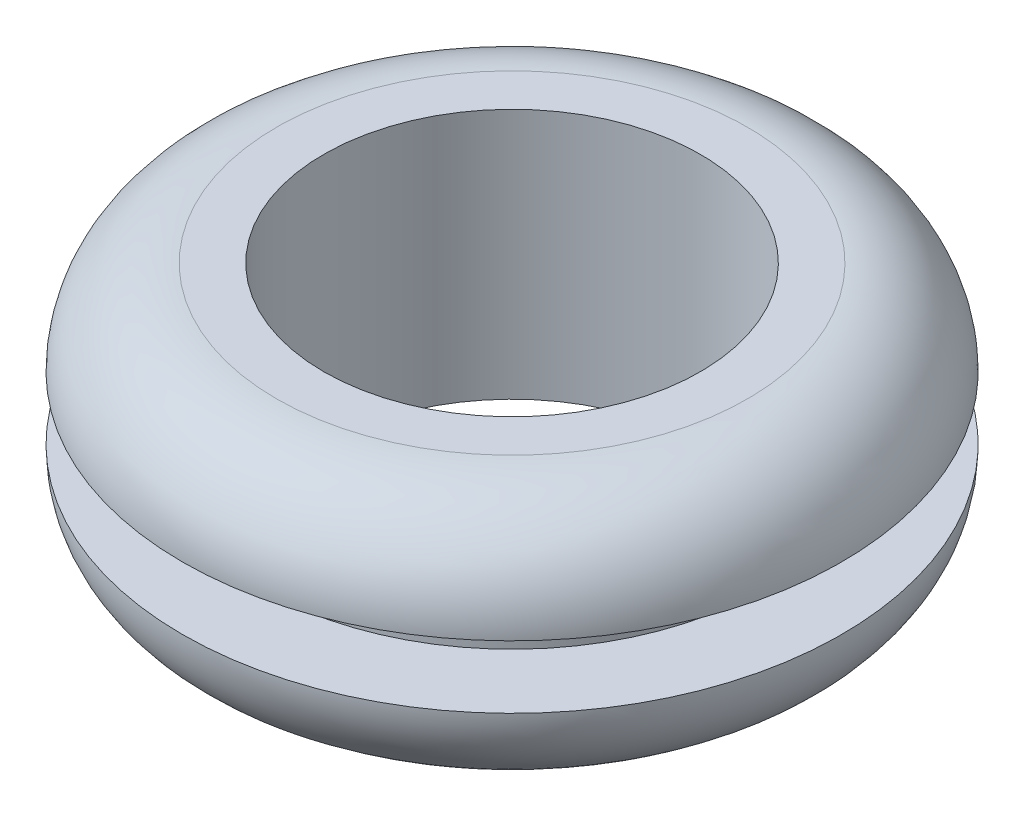
ISO-10303-21;
HEADER;
FILE_DESCRIPTION(('STEP AP214'),'2;1');
FILE_NAME('part.step','',(''),(''),'','','');
FILE_SCHEMA(('AUTOMOTIVE_DESIGN { 1 0 10303 214 1 1 1 1 }'));
ENDSEC;
DATA;
#1=APPLICATION_CONTEXT('core data for automotive mechanical design processes');
#2=APPLICATION_PROTOCOL_DEFINITION('international standard','automotive_design',2000,#1);
#3=PRODUCT_CONTEXT('',#1,'mechanical');
#4=PRODUCT('Part','Part','',(#3));
#5=PRODUCT_RELATED_PRODUCT_CATEGORY('part','',(#4));
#6=PRODUCT_DEFINITION_FORMATION('','',#4);
#7=PRODUCT_DEFINITION_CONTEXT('part definition',#1,'design');
#8=PRODUCT_DEFINITION('design','',#6,#7);
#9=PRODUCT_DEFINITION_SHAPE('','',#8);
#10=(LENGTH_UNIT() NAMED_UNIT(*) SI_UNIT(.MILLI.,.METRE.));
#11=(NAMED_UNIT(*) PLANE_ANGLE_UNIT() SI_UNIT($,.RADIAN.));
#12=(NAMED_UNIT(*) SI_UNIT($,.STERADIAN.) SOLID_ANGLE_UNIT());
#13=UNCERTAINTY_MEASURE_WITH_UNIT(LENGTH_MEASURE(1.E-05),#10,'distance_accuracy_value','');
#14=(GEOMETRIC_REPRESENTATION_CONTEXT(3) GLOBAL_UNCERTAINTY_ASSIGNED_CONTEXT((#13)) GLOBAL_UNIT_ASSIGNED_CONTEXT((#10,
#11,#12)) REPRESENTATION_CONTEXT('',''));
#15=CARTESIAN_POINT('',(0.,0.,0.));
#16=DIRECTION('',(0.,0.,1.));
#17=DIRECTION('',(1.,0.,0.));
#18=AXIS2_PLACEMENT_3D('',#15,#16,#17);
#19=CARTESIAN_POINT('',(0.,3.175,0.));
#20=DIRECTION('',(0.,1.,0.));
#21=DIRECTION('',(0.,0.,1.));
#22=AXIS2_PLACEMENT_3D('',#19,#20,#21);
#23=CYLINDRICAL_SURFACE('',#22,6.35);
#24=CARTESIAN_POINT('',(0.,0.79375,0.));
#25=DIRECTION('',(0.,1.,0.));
#26=DIRECTION('',(0.,0.,1.));
#27=AXIS2_PLACEMENT_3D('',#24,#25,#26);
#28=CIRCLE('',#27,6.35);
#29=CARTESIAN_POINT('',(0.,0.79375,6.35));
#30=VERTEX_POINT('',#29);
#31=EDGE_CURVE('E10',#30,#30,#28,.T.);
#32=ORIENTED_EDGE('',*,*,#31,.F.);
#33=EDGE_LOOP('',(#32));
#34=FACE_BOUND('',#33,.T.);
#35=CARTESIAN_POINT('',(0.,-0.79375,0.));
#36=DIRECTION('',(0.,1.,0.));
#37=DIRECTION('',(0.,0.,1.));
#38=AXIS2_PLACEMENT_3D('',#35,#36,#37);
#39=CIRCLE('',#38,6.35);
#40=CARTESIAN_POINT('',(0.,-0.79375,6.35));
#41=VERTEX_POINT('',#40);
#42=EDGE_CURVE('E58',#41,#41,#39,.T.);
#43=ORIENTED_EDGE('',*,*,#42,.T.);
#44=EDGE_LOOP('',(#43));
#45=FACE_BOUND('',#44,.T.);
#46=ADVANCED_FACE('F30',(#34,#45),#23,.T.);
#47=CARTESIAN_POINT('',(6.35,0.79375,0.));
#48=DIRECTION('',(0.,1.,0.));
#49=DIRECTION('',(0.,0.,1.));
#50=AXIS2_PLACEMENT_3D('',#47,#48,#49);
#51=PLANE('',#50);
#52=CARTESIAN_POINT('',(0.,0.79375,0.));
#53=DIRECTION('',(0.,1.,0.));
#54=DIRECTION('',(0.,0.,1.));
#55=AXIS2_PLACEMENT_3D('',#52,#53,#54);
#56=CIRCLE('',#55,8.334375);
#57=CARTESIAN_POINT('',(0.,0.79375,8.334375));
#58=VERTEX_POINT('',#57);
#59=EDGE_CURVE('E36',#58,#58,#56,.T.);
#60=ORIENTED_EDGE('',*,*,#59,.F.);
#61=EDGE_LOOP('',(#60));
#62=FACE_BOUND('',#61,.T.);
#63=ORIENTED_EDGE('',*,*,#31,.T.);
#64=EDGE_LOOP('',(#63));
#65=FACE_BOUND('',#64,.T.);
#66=ADVANCED_FACE('F95',(#62,#65),#51,.F.);
#67=CARTESIAN_POINT('',(0.,0.79375,0.));
#68=DIRECTION('',(0.,1.,0.));
#69=DIRECTION('',(0.,0.,1.));
#70=AXIS2_PLACEMENT_3D('',#67,#68,#69);
#71=TOROIDAL_SURFACE('',#70,5.953125,2.38125);
#72=CARTESIAN_POINT('',(0.,3.175,0.));
#73=DIRECTION('',(0.,1.,0.));
#74=DIRECTION('',(0.,0.,1.));
#75=AXIS2_PLACEMENT_3D('',#72,#73,#74);
#76=CIRCLE('',#75,5.953125);
#77=CARTESIAN_POINT('',(0.,3.175,5.953125));
#78=VERTEX_POINT('',#77);
#79=EDGE_CURVE('E40',#78,#78,#76,.T.);
#80=ORIENTED_EDGE('',*,*,#79,.F.);
#81=EDGE_LOOP('',(#80));
#82=FACE_BOUND('',#81,.T.);
#83=ORIENTED_EDGE('',*,*,#59,.T.);
#84=EDGE_LOOP('',(#83));
#85=FACE_BOUND('',#84,.T.);
#86=ADVANCED_FACE('F90',(#82,#85),#71,.T.);
#87=CARTESIAN_POINT('',(4.7625,3.175,0.));
#88=DIRECTION('',(0.,-1.,0.));
#89=DIRECTION('',(0.,0.,-1.));
#90=AXIS2_PLACEMENT_3D('',#87,#88,#89);
#91=PLANE('',#90);
#92=CARTESIAN_POINT('',(0.,3.175,0.));
#93=DIRECTION('',(0.,1.,0.));
#94=DIRECTION('',(0.,0.,1.));
#95=AXIS2_PLACEMENT_3D('',#92,#93,#94);
#96=CIRCLE('',#95,4.7625);
#97=CARTESIAN_POINT('',(0.,3.175,4.7625));
#98=VERTEX_POINT('',#97);
#99=EDGE_CURVE('E44',#98,#98,#96,.T.);
#100=ORIENTED_EDGE('',*,*,#99,.F.);
#101=EDGE_LOOP('',(#100));
#102=FACE_BOUND('',#101,.T.);
#103=ORIENTED_EDGE('',*,*,#79,.T.);
#104=EDGE_LOOP('',(#103));
#105=FACE_BOUND('',#104,.T.);
#106=ADVANCED_FACE('F84',(#102,#105),#91,.F.);
#107=CARTESIAN_POINT('',(0.,3.175,0.));
#108=DIRECTION('',(0.,1.,0.));
#109=DIRECTION('',(0.,0.,1.));
#110=AXIS2_PLACEMENT_3D('',#107,#108,#109);
#111=CYLINDRICAL_SURFACE('',#110,4.7625);
#112=CARTESIAN_POINT('',(0.,-3.175,0.));
#113=DIRECTION('',(0.,1.,0.));
#114=DIRECTION('',(0.,0.,1.));
#115=AXIS2_PLACEMENT_3D('',#112,#113,#114);
#116=CIRCLE('',#115,4.7625);
#117=CARTESIAN_POINT('',(0.,-3.175,4.7625));
#118=VERTEX_POINT('',#117);
#119=EDGE_CURVE('E49',#118,#118,#116,.T.);
#120=ORIENTED_EDGE('',*,*,#119,.F.);
#121=EDGE_LOOP('',(#120));
#122=FACE_BOUND('',#121,.T.);
#123=ORIENTED_EDGE('',*,*,#99,.T.);
#124=EDGE_LOOP('',(#123));
#125=FACE_BOUND('',#124,.T.);
#126=ADVANCED_FACE('F78',(#122,#125),#111,.F.);
#127=CARTESIAN_POINT('',(4.7625,-3.175,0.));
#128=DIRECTION('',(0.,1.,0.));
#129=DIRECTION('',(0.,0.,1.));
#130=AXIS2_PLACEMENT_3D('',#127,#128,#129);
#131=PLANE('',#130);
#132=CARTESIAN_POINT('',(0.,-3.175,0.));
#133=DIRECTION('',(0.,1.,0.));
#134=DIRECTION('',(0.,0.,1.));
#135=AXIS2_PLACEMENT_3D('',#132,#133,#134);
#136=CIRCLE('',#135,5.953125);
#137=CARTESIAN_POINT('',(0.,-3.175,5.953125));
#138=VERTEX_POINT('',#137);
#139=EDGE_CURVE('E52',#138,#138,#136,.T.);
#140=ORIENTED_EDGE('',*,*,#139,.F.);
#141=EDGE_LOOP('',(#140));
#142=FACE_BOUND('',#141,.T.);
#143=ORIENTED_EDGE('',*,*,#119,.T.);
#144=EDGE_LOOP('',(#143));
#145=FACE_BOUND('',#144,.T.);
#146=ADVANCED_FACE('F72',(#142,#145),#131,.F.);
#147=CARTESIAN_POINT('',(0.,-0.79375,0.));
#148=DIRECTION('',(0.,1.,0.));
#149=DIRECTION('',(0.,0.,1.));
#150=AXIS2_PLACEMENT_3D('',#147,#148,#149);
#151=TOROIDAL_SURFACE('',#150,5.953125,2.38125);
#152=CARTESIAN_POINT('',(0.,-0.79375,0.));
#153=DIRECTION('',(0.,1.,0.));
#154=DIRECTION('',(0.,0.,1.));
#155=AXIS2_PLACEMENT_3D('',#152,#153,#154);
#156=CIRCLE('',#155,8.334375);
#157=CARTESIAN_POINT('',(0.,-0.79375,8.334375));
#158=VERTEX_POINT('',#157);
#159=EDGE_CURVE('E55',#158,#158,#156,.T.);
#160=ORIENTED_EDGE('',*,*,#159,.F.);
#161=EDGE_LOOP('',(#160));
#162=FACE_BOUND('',#161,.T.);
#163=ORIENTED_EDGE('',*,*,#139,.T.);
#164=EDGE_LOOP('',(#163));
#165=FACE_BOUND('',#164,.T.);
#166=ADVANCED_FACE('F66',(#162,#165),#151,.T.);
#167=CARTESIAN_POINT('',(8.334375,-0.79375,0.));
#168=DIRECTION('',(0.,-1.,0.));
#169=DIRECTION('',(0.,0.,-1.));
#170=AXIS2_PLACEMENT_3D('',#167,#168,#169);
#171=PLANE('',#170);
#172=ORIENTED_EDGE('',*,*,#42,.F.);
#173=EDGE_LOOP('',(#172));
#174=FACE_BOUND('',#173,.T.);
#175=ORIENTED_EDGE('',*,*,#159,.T.);
#176=EDGE_LOOP('',(#175));
#177=FACE_BOUND('',#176,.T.);
#178=ADVANCED_FACE('F63',(#174,#177),#171,.F.);
#179=CLOSED_SHELL('',(#46,#66,#86,#106,#126,#146,#166,#178));
#180=MANIFOLD_SOLID_BREP('B2',#179);
#181=ADVANCED_BREP_SHAPE_REPRESENTATION('',(#18,#180),#14);
#182=SHAPE_DEFINITION_REPRESENTATION(#9,#181);
ENDSEC;
END-ISO-10303-21;
